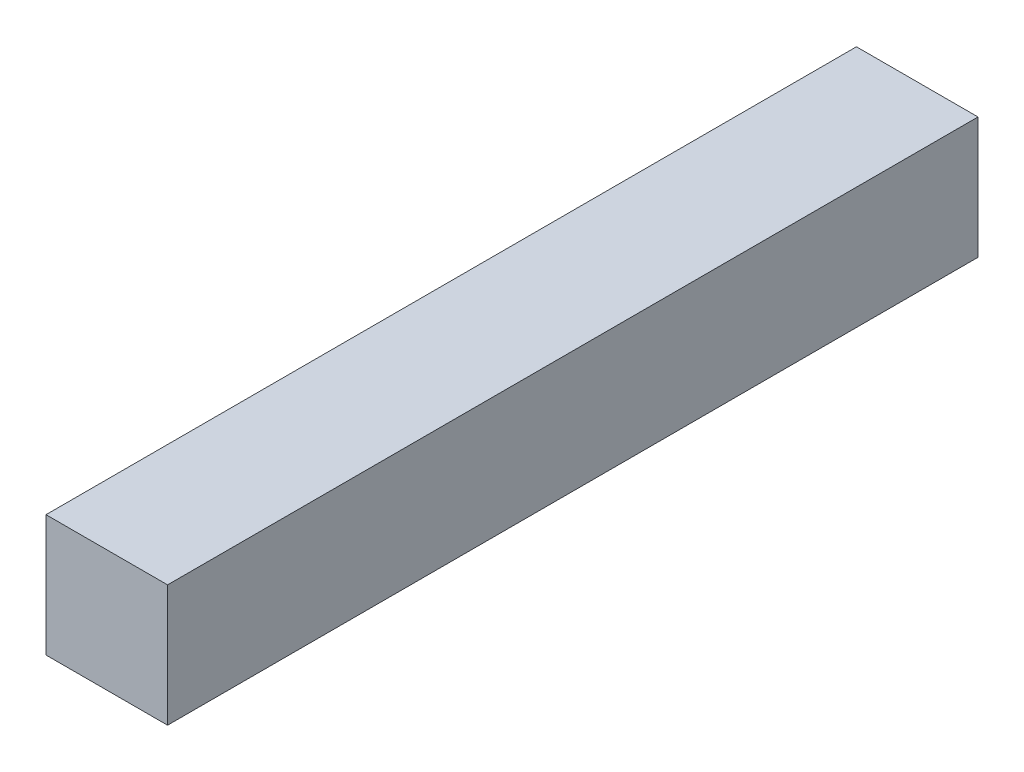
ISO-10303-21;
HEADER;
FILE_DESCRIPTION(('STEP AP214'),'2;1');
FILE_NAME('part.step','',(''),(''),'','','');
FILE_SCHEMA(('AUTOMOTIVE_DESIGN { 1 0 10303 214 1 1 1 1 }'));
ENDSEC;
DATA;
#1=APPLICATION_CONTEXT('core data for automotive mechanical design processes');
#2=APPLICATION_PROTOCOL_DEFINITION('international standard','automotive_design',2000,#1);
#3=PRODUCT_CONTEXT('',#1,'mechanical');
#4=PRODUCT('Part','Part','',(#3));
#5=PRODUCT_RELATED_PRODUCT_CATEGORY('part','',(#4));
#6=PRODUCT_DEFINITION_FORMATION('','',#4);
#7=PRODUCT_DEFINITION_CONTEXT('part definition',#1,'design');
#8=PRODUCT_DEFINITION('design','',#6,#7);
#9=PRODUCT_DEFINITION_SHAPE('','',#8);
#10=(LENGTH_UNIT() NAMED_UNIT(*) SI_UNIT(.MILLI.,.METRE.));
#11=(NAMED_UNIT(*) PLANE_ANGLE_UNIT() SI_UNIT($,.RADIAN.));
#12=(NAMED_UNIT(*) SI_UNIT($,.STERADIAN.) SOLID_ANGLE_UNIT());
#13=UNCERTAINTY_MEASURE_WITH_UNIT(LENGTH_MEASURE(1.E-05),#10,'distance_accuracy_value','');
#14=(GEOMETRIC_REPRESENTATION_CONTEXT(3) GLOBAL_UNCERTAINTY_ASSIGNED_CONTEXT((#13)) GLOBAL_UNIT_ASSIGNED_CONTEXT((#10,
#11,#12)) REPRESENTATION_CONTEXT('',''));
#15=CARTESIAN_POINT('',(0.,0.,0.));
#16=DIRECTION('',(0.,0.,1.));
#17=DIRECTION('',(1.,0.,0.));
#18=AXIS2_PLACEMENT_3D('',#15,#16,#17);
#19=CARTESIAN_POINT('',(0.,0.,254.));
#20=DIRECTION('',(1.,0.,0.));
#21=DIRECTION('',(0.,0.,-1.));
#22=AXIS2_PLACEMENT_3D('',#19,#20,#21);
#23=PLANE('',#22);
#24=DIRECTION('',(0.,-1.,0.));
#25=VECTOR('',#24,1.);
#26=CARTESIAN_POINT('',(0.,0.,0.));
#27=LINE('',#26,#25);
#28=CARTESIAN_POINT('',(0.,38.1,0.));
#29=VERTEX_POINT('',#28);
#30=CARTESIAN_POINT('',(0.,0.,0.));
#31=VERTEX_POINT('',#30);
#32=EDGE_CURVE('E95',#29,#31,#27,.T.);
#33=ORIENTED_EDGE('',*,*,#32,.T.);
#34=DIRECTION('',(0.,0.,-1.));
#35=VECTOR('',#34,1.);
#36=CARTESIAN_POINT('',(0.,0.,254.));
#37=LINE('',#36,#35);
#38=CARTESIAN_POINT('',(0.,0.,254.));
#39=VERTEX_POINT('',#38);
#40=EDGE_CURVE('E11',#39,#31,#37,.T.);
#41=ORIENTED_EDGE('',*,*,#40,.F.);
#42=DIRECTION('',(0.,-1.,0.));
#43=VECTOR('',#42,1.);
#44=CARTESIAN_POINT('',(0.,0.,254.));
#45=LINE('',#44,#43);
#46=CARTESIAN_POINT('',(0.,38.1,254.));
#47=VERTEX_POINT('',#46);
#48=EDGE_CURVE('E83',#47,#39,#45,.T.);
#49=ORIENTED_EDGE('',*,*,#48,.F.);
#50=DIRECTION('',(0.,0.,-1.));
#51=VECTOR('',#50,1.);
#52=CARTESIAN_POINT('',(0.,38.1,254.));
#53=LINE('',#52,#51);
#54=EDGE_CURVE('E91',#47,#29,#53,.T.);
#55=ORIENTED_EDGE('',*,*,#54,.T.);
#56=EDGE_LOOP('',(#33,#41,#49,#55));
#57=FACE_BOUND('',#56,.T.);
#58=ADVANCED_FACE('F32',(#57),#23,.F.);
#59=CARTESIAN_POINT('',(0.,0.,254.));
#60=DIRECTION('',(0.,1.,0.));
#61=DIRECTION('',(0.,0.,1.));
#62=AXIS2_PLACEMENT_3D('',#59,#60,#61);
#63=PLANE('',#62);
#64=DIRECTION('',(1.,0.,0.));
#65=VECTOR('',#64,1.);
#66=CARTESIAN_POINT('',(0.,0.,0.));
#67=LINE('',#66,#65);
#68=CARTESIAN_POINT('',(38.1,0.,0.));
#69=VERTEX_POINT('',#68);
#70=EDGE_CURVE('E87',#31,#69,#67,.T.);
#71=ORIENTED_EDGE('',*,*,#70,.T.);
#72=DIRECTION('',(0.,0.,-1.));
#73=VECTOR('',#72,1.);
#74=CARTESIAN_POINT('',(38.1,0.,254.));
#75=LINE('',#74,#73);
#76=CARTESIAN_POINT('',(38.1,0.,254.));
#77=VERTEX_POINT('',#76);
#78=EDGE_CURVE('E40',#77,#69,#75,.T.);
#79=ORIENTED_EDGE('',*,*,#78,.F.);
#80=DIRECTION('',(1.,0.,0.));
#81=VECTOR('',#80,1.);
#82=CARTESIAN_POINT('',(0.,0.,254.));
#83=LINE('',#82,#81);
#84=EDGE_CURVE('E78',#39,#77,#83,.T.);
#85=ORIENTED_EDGE('',*,*,#84,.F.);
#86=ORIENTED_EDGE('',*,*,#40,.T.);
#87=EDGE_LOOP('',(#71,#79,#85,#86));
#88=FACE_BOUND('',#87,.T.);
#89=ADVANCED_FACE('F86',(#88),#63,.F.);
#90=CARTESIAN_POINT('',(38.1,0.,254.));
#91=DIRECTION('',(-1.,0.,0.));
#92=DIRECTION('',(0.,-1.,0.));
#93=AXIS2_PLACEMENT_3D('',#90,#91,#92);
#94=PLANE('',#93);
#95=DIRECTION('',(0.,1.,0.));
#96=VECTOR('',#95,1.);
#97=CARTESIAN_POINT('',(38.1,0.,0.));
#98=LINE('',#97,#96);
#99=CARTESIAN_POINT('',(38.1,38.1,0.));
#100=VERTEX_POINT('',#99);
#101=EDGE_CURVE('E65',#69,#100,#98,.T.);
#102=ORIENTED_EDGE('',*,*,#101,.T.);
#103=DIRECTION('',(0.,0.,-1.));
#104=VECTOR('',#103,1.);
#105=CARTESIAN_POINT('',(38.1,38.1,254.));
#106=LINE('',#105,#104);
#107=CARTESIAN_POINT('',(38.1,38.1,254.));
#108=VERTEX_POINT('',#107);
#109=EDGE_CURVE('E88',#108,#100,#106,.T.);
#110=ORIENTED_EDGE('',*,*,#109,.F.);
#111=DIRECTION('',(0.,1.,0.));
#112=VECTOR('',#111,1.);
#113=CARTESIAN_POINT('',(38.1,0.,254.));
#114=LINE('',#113,#112);
#115=EDGE_CURVE('E81',#77,#108,#114,.T.);
#116=ORIENTED_EDGE('',*,*,#115,.F.);
#117=ORIENTED_EDGE('',*,*,#78,.T.);
#118=EDGE_LOOP('',(#102,#110,#116,#117));
#119=FACE_BOUND('',#118,.T.);
#120=ADVANCED_FACE('F89',(#119),#94,.F.);
#121=CARTESIAN_POINT('',(0.,38.1,254.));
#122=DIRECTION('',(0.,-1.,0.));
#123=DIRECTION('',(0.,0.,-1.));
#124=AXIS2_PLACEMENT_3D('',#121,#122,#123);
#125=PLANE('',#124);
#126=DIRECTION('',(-1.,0.,0.));
#127=VECTOR('',#126,1.);
#128=CARTESIAN_POINT('',(0.,38.1,0.));
#129=LINE('',#128,#127);
#130=EDGE_CURVE('E71',#100,#29,#129,.T.);
#131=ORIENTED_EDGE('',*,*,#130,.T.);
#132=ORIENTED_EDGE('',*,*,#54,.F.);
#133=DIRECTION('',(-1.,0.,0.));
#134=VECTOR('',#133,1.);
#135=CARTESIAN_POINT('',(0.,38.1,254.));
#136=LINE('',#135,#134);
#137=EDGE_CURVE('E48',#108,#47,#136,.T.);
#138=ORIENTED_EDGE('',*,*,#137,.F.);
#139=ORIENTED_EDGE('',*,*,#109,.T.);
#140=EDGE_LOOP('',(#131,#132,#138,#139));
#141=FACE_BOUND('',#140,.T.);
#142=ADVANCED_FACE('F102',(#141),#125,.F.);
#143=CARTESIAN_POINT('',(0.,0.,254.));
#144=DIRECTION('',(0.,0.,-1.));
#145=DIRECTION('',(-1.,0.,0.));
#146=AXIS2_PLACEMENT_3D('',#143,#144,#145);
#147=PLANE('',#146);
#148=ORIENTED_EDGE('',*,*,#48,.T.);
#149=ORIENTED_EDGE('',*,*,#84,.T.);
#150=ORIENTED_EDGE('',*,*,#115,.T.);
#151=ORIENTED_EDGE('',*,*,#137,.T.);
#152=EDGE_LOOP('',(#148,#149,#150,#151));
#153=FACE_BOUND('',#152,.T.);
#154=ADVANCED_FACE('F79',(#153),#147,.F.);
#155=CARTESIAN_POINT('',(0.,0.,0.));
#156=DIRECTION('',(0.,0.,-1.));
#157=DIRECTION('',(-1.,0.,0.));
#158=AXIS2_PLACEMENT_3D('',#155,#156,#157);
#159=PLANE('',#158);
#160=ORIENTED_EDGE('',*,*,#32,.F.);
#161=ORIENTED_EDGE('',*,*,#130,.F.);
#162=ORIENTED_EDGE('',*,*,#101,.F.);
#163=ORIENTED_EDGE('',*,*,#70,.F.);
#164=EDGE_LOOP('',(#160,#161,#162,#163));
#165=FACE_BOUND('',#164,.T.);
#166=ADVANCED_FACE('F105',(#165),#159,.T.);
#167=CLOSED_SHELL('',(#58,#89,#120,#142,#154,#166));
#168=MANIFOLD_SOLID_BREP('B2',#167);
#169=ADVANCED_BREP_SHAPE_REPRESENTATION('',(#18,#168),#14);
#170=SHAPE_DEFINITION_REPRESENTATION(#9,#169);
ENDSEC;
END-ISO-10303-21;
